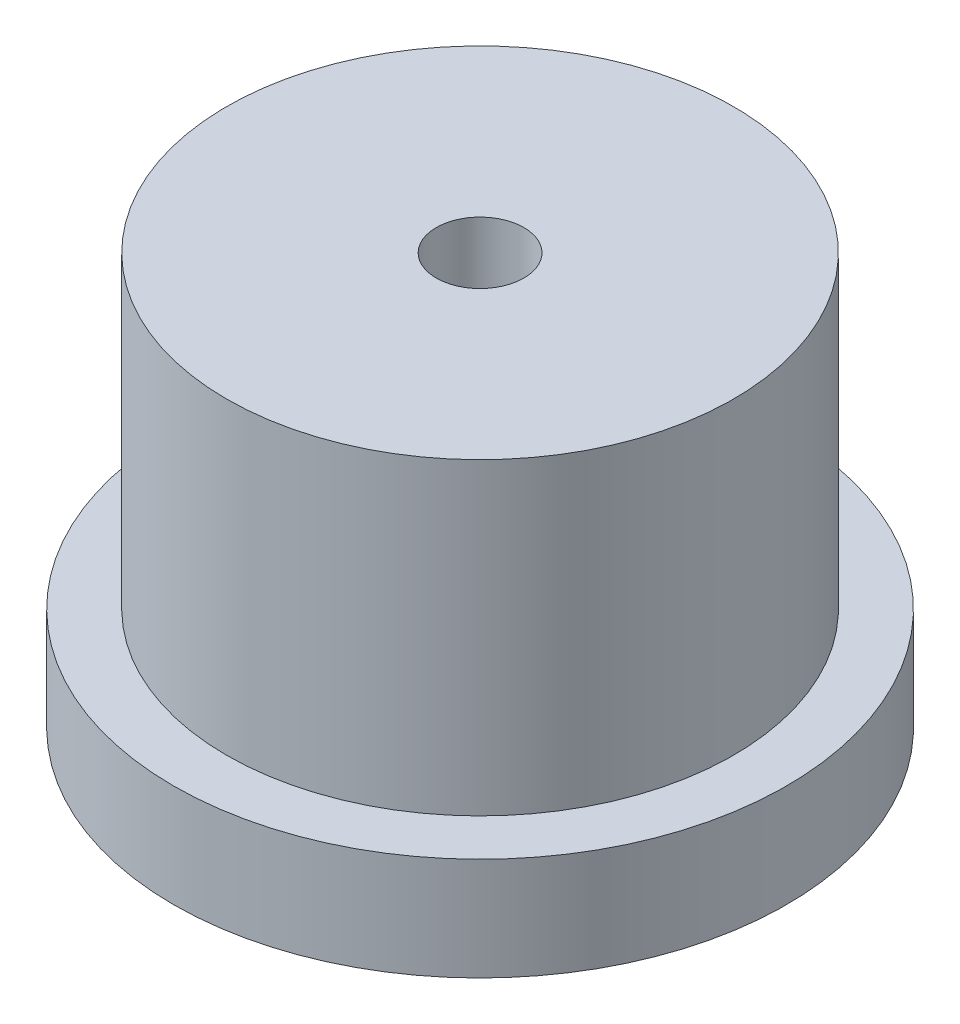
ISO-10303-21;
HEADER;
FILE_DESCRIPTION(('STEP AP214'),'2;1');
FILE_NAME('part.step','',(''),(''),'','','');
FILE_SCHEMA(('AUTOMOTIVE_DESIGN { 1 0 10303 214 1 1 1 1 }'));
ENDSEC;
DATA;
#1=APPLICATION_CONTEXT('core data for automotive mechanical design processes');
#2=APPLICATION_PROTOCOL_DEFINITION('international standard','automotive_design',2000,#1);
#3=PRODUCT_CONTEXT('',#1,'mechanical');
#4=PRODUCT('Part','Part','',(#3));
#5=PRODUCT_RELATED_PRODUCT_CATEGORY('part','',(#4));
#6=PRODUCT_DEFINITION_FORMATION('','',#4);
#7=PRODUCT_DEFINITION_CONTEXT('part definition',#1,'design');
#8=PRODUCT_DEFINITION('design','',#6,#7);
#9=PRODUCT_DEFINITION_SHAPE('','',#8);
#10=(LENGTH_UNIT() NAMED_UNIT(*) SI_UNIT(.MILLI.,.METRE.));
#11=(NAMED_UNIT(*) PLANE_ANGLE_UNIT() SI_UNIT($,.RADIAN.));
#12=(NAMED_UNIT(*) SI_UNIT($,.STERADIAN.) SOLID_ANGLE_UNIT());
#13=UNCERTAINTY_MEASURE_WITH_UNIT(LENGTH_MEASURE(1.E-05),#10,'distance_accuracy_value','');
#14=(GEOMETRIC_REPRESENTATION_CONTEXT(3) GLOBAL_UNCERTAINTY_ASSIGNED_CONTEXT((#13)) GLOBAL_UNIT_ASSIGNED_CONTEXT((#10,
#11,#12)) REPRESENTATION_CONTEXT('',''));
#15=CARTESIAN_POINT('',(0.,0.,0.));
#16=DIRECTION('',(0.,0.,1.));
#17=DIRECTION('',(1.,0.,0.));
#18=AXIS2_PLACEMENT_3D('',#15,#16,#17);
#19=CARTESIAN_POINT('',(0.,3.175,0.));
#20=DIRECTION('',(0.,1.,0.));
#21=DIRECTION('',(0.,0.,1.));
#22=AXIS2_PLACEMENT_3D('',#19,#20,#21);
#23=PLANE('',#22);
#24=CARTESIAN_POINT('',(0.,3.175,0.));
#25=DIRECTION('',(0.,1.,0.));
#26=DIRECTION('',(0.,0.,1.));
#27=AXIS2_PLACEMENT_3D('',#24,#25,#26);
#28=CIRCLE('',#27,9.4615);
#29=CARTESIAN_POINT('',(0.,3.175,9.4615));
#30=VERTEX_POINT('',#29);
#31=EDGE_CURVE('E10',#30,#30,#28,.T.);
#32=ORIENTED_EDGE('',*,*,#31,.T.);
#33=EDGE_LOOP('',(#32));
#34=FACE_BOUND('',#33,.T.);
#35=CARTESIAN_POINT('',(0.,3.175,0.));
#36=DIRECTION('',(0.,1.,0.));
#37=DIRECTION('',(0.,0.,1.));
#38=AXIS2_PLACEMENT_3D('',#35,#36,#37);
#39=CIRCLE('',#38,7.8232);
#40=CARTESIAN_POINT('',(0.,3.175,7.8232));
#41=VERTEX_POINT('',#40);
#42=EDGE_CURVE('E47',#41,#41,#39,.T.);
#43=ORIENTED_EDGE('',*,*,#42,.F.);
#44=EDGE_LOOP('',(#43));
#45=FACE_BOUND('',#44,.T.);
#46=ADVANCED_FACE('F34',(#34,#45),#23,.T.);
#47=CARTESIAN_POINT('',(0.,3.175,0.));
#48=DIRECTION('',(0.,-1.,0.));
#49=DIRECTION('',(0.,0.,-1.));
#50=AXIS2_PLACEMENT_3D('',#47,#48,#49);
#51=CYLINDRICAL_SURFACE('',#50,9.4615);
#52=ORIENTED_EDGE('',*,*,#31,.F.);
#53=EDGE_LOOP('',(#52));
#54=FACE_BOUND('',#53,.T.);
#55=CARTESIAN_POINT('',(0.,0.,0.));
#56=DIRECTION('',(0.,1.,0.));
#57=DIRECTION('',(0.,0.,1.));
#58=AXIS2_PLACEMENT_3D('',#55,#56,#57);
#59=CIRCLE('',#58,9.4615);
#60=CARTESIAN_POINT('',(0.,0.,9.4615));
#61=VERTEX_POINT('',#60);
#62=EDGE_CURVE('E38',#61,#61,#59,.T.);
#63=ORIENTED_EDGE('',*,*,#62,.T.);
#64=EDGE_LOOP('',(#63));
#65=FACE_BOUND('',#64,.T.);
#66=ADVANCED_FACE('F36',(#54,#65),#51,.T.);
#67=CARTESIAN_POINT('',(0.,0.,0.));
#68=DIRECTION('',(0.,1.,0.));
#69=DIRECTION('',(0.,0.,1.));
#70=AXIS2_PLACEMENT_3D('',#67,#68,#69);
#71=PLANE('',#70);
#72=CARTESIAN_POINT('',(0.,0.,0.));
#73=DIRECTION('',(0.,-1.,0.));
#74=DIRECTION('',(0.,0.,-1.));
#75=AXIS2_PLACEMENT_3D('',#72,#73,#74);
#76=CIRCLE('',#75,1.35254999999999);
#77=CARTESIAN_POINT('',(0.,0.,-1.35254999999999));
#78=VERTEX_POINT('',#77);
#79=EDGE_CURVE('E50',#78,#78,#76,.T.);
#80=ORIENTED_EDGE('',*,*,#79,.F.);
#81=EDGE_LOOP('',(#80));
#82=FACE_BOUND('',#81,.T.);
#83=ORIENTED_EDGE('',*,*,#62,.F.);
#84=EDGE_LOOP('',(#83));
#85=FACE_BOUND('',#84,.T.);
#86=ADVANCED_FACE('F68',(#82,#85),#71,.F.);
#87=CARTESIAN_POINT('',(0.,12.7,0.));
#88=DIRECTION('',(0.,-1.,0.));
#89=DIRECTION('',(0.,0.,-1.));
#90=AXIS2_PLACEMENT_3D('',#87,#88,#89);
#91=CYLINDRICAL_SURFACE('',#90,7.8232);
#92=CARTESIAN_POINT('',(0.,12.7,0.));
#93=DIRECTION('',(0.,1.,0.));
#94=DIRECTION('',(0.,0.,1.));
#95=AXIS2_PLACEMENT_3D('',#92,#93,#94);
#96=CIRCLE('',#95,7.8232);
#97=CARTESIAN_POINT('',(0.,12.7,7.8232));
#98=VERTEX_POINT('',#97);
#99=EDGE_CURVE('E45',#98,#98,#96,.T.);
#100=ORIENTED_EDGE('',*,*,#99,.F.);
#101=EDGE_LOOP('',(#100));
#102=FACE_BOUND('',#101,.T.);
#103=ORIENTED_EDGE('',*,*,#42,.T.);
#104=EDGE_LOOP('',(#103));
#105=FACE_BOUND('',#104,.T.);
#106=ADVANCED_FACE('F71',(#102,#105),#91,.T.);
#107=CARTESIAN_POINT('',(0.,12.7,0.));
#108=DIRECTION('',(0.,1.,0.));
#109=DIRECTION('',(0.,0.,1.));
#110=AXIS2_PLACEMENT_3D('',#107,#108,#109);
#111=PLANE('',#110);
#112=CARTESIAN_POINT('',(0.,12.7,0.));
#113=DIRECTION('',(0.,-1.,0.));
#114=DIRECTION('',(0.,0.,-1.));
#115=AXIS2_PLACEMENT_3D('',#112,#113,#114);
#116=CIRCLE('',#115,1.35254999999999);
#117=CARTESIAN_POINT('',(0.,12.7,-1.35254999999999));
#118=VERTEX_POINT('',#117);
#119=EDGE_CURVE('E55',#118,#118,#116,.T.);
#120=ORIENTED_EDGE('',*,*,#119,.T.);
#121=EDGE_LOOP('',(#120));
#122=FACE_BOUND('',#121,.T.);
#123=ORIENTED_EDGE('',*,*,#99,.T.);
#124=EDGE_LOOP('',(#123));
#125=FACE_BOUND('',#124,.T.);
#126=ADVANCED_FACE('F59',(#122,#125),#111,.T.);
#127=CARTESIAN_POINT('',(0.,0.,0.));
#128=DIRECTION('',(0.,-1.,0.));
#129=DIRECTION('',(0.,0.,-1.));
#130=AXIS2_PLACEMENT_3D('',#127,#128,#129);
#131=CYLINDRICAL_SURFACE('',#130,1.35254999999999);
#132=ORIENTED_EDGE('',*,*,#119,.F.);
#133=EDGE_LOOP('',(#132));
#134=FACE_BOUND('',#133,.T.);
#135=ORIENTED_EDGE('',*,*,#79,.T.);
#136=EDGE_LOOP('',(#135));
#137=FACE_BOUND('',#136,.T.);
#138=ADVANCED_FACE('F62',(#134,#137),#131,.F.);
#139=CLOSED_SHELL('',(#46,#66,#86,#106,#126,#138));
#140=MANIFOLD_SOLID_BREP('B2',#139);
#141=ADVANCED_BREP_SHAPE_REPRESENTATION('',(#18,#140),#14);
#142=SHAPE_DEFINITION_REPRESENTATION(#9,#141);
ENDSEC;
END-ISO-10303-21;
